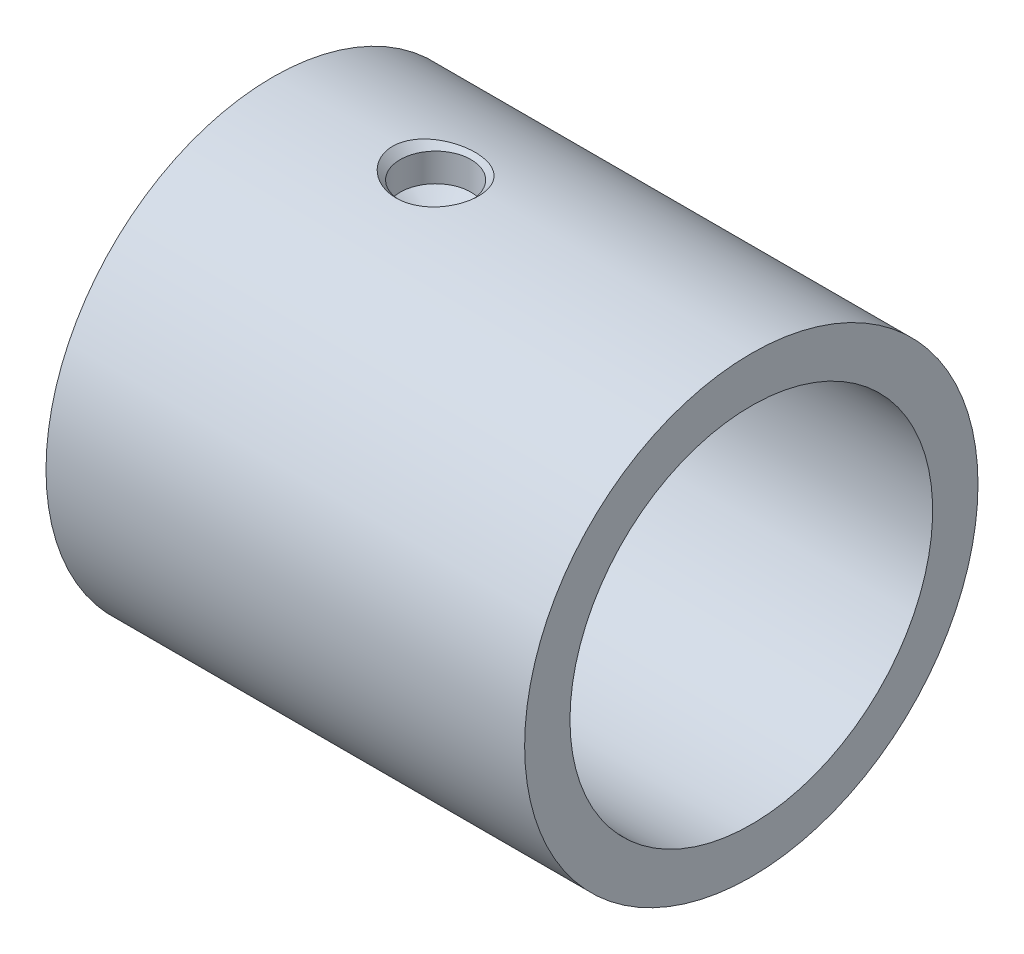
ISO-10303-21;
HEADER;
FILE_DESCRIPTION(('STEP AP214'),'2;1');
FILE_NAME('part.step','',(''),(''),'','','');
FILE_SCHEMA(('AUTOMOTIVE_DESIGN { 1 0 10303 214 1 1 1 1 }'));
ENDSEC;
DATA;
#1=APPLICATION_CONTEXT('core data for automotive mechanical design processes');
#2=APPLICATION_PROTOCOL_DEFINITION('international standard','automotive_design',2000,#1);
#3=PRODUCT_CONTEXT('',#1,'mechanical');
#4=PRODUCT('Part','Part','',(#3));
#5=PRODUCT_RELATED_PRODUCT_CATEGORY('part','',(#4));
#6=PRODUCT_DEFINITION_FORMATION('','',#4);
#7=PRODUCT_DEFINITION_CONTEXT('part definition',#1,'design');
#8=PRODUCT_DEFINITION('design','',#6,#7);
#9=PRODUCT_DEFINITION_SHAPE('','',#8);
#10=(LENGTH_UNIT() NAMED_UNIT(*) SI_UNIT(.MILLI.,.METRE.));
#11=(NAMED_UNIT(*) PLANE_ANGLE_UNIT() SI_UNIT($,.RADIAN.));
#12=(NAMED_UNIT(*) SI_UNIT($,.STERADIAN.) SOLID_ANGLE_UNIT());
#13=UNCERTAINTY_MEASURE_WITH_UNIT(LENGTH_MEASURE(1.E-05),#10,'distance_accuracy_value','');
#14=(GEOMETRIC_REPRESENTATION_CONTEXT(3) GLOBAL_UNCERTAINTY_ASSIGNED_CONTEXT((#13)) GLOBAL_UNIT_ASSIGNED_CONTEXT((#10,
#11,#12)) REPRESENTATION_CONTEXT('',''));
#15=CARTESIAN_POINT('',(0.,0.,0.));
#16=DIRECTION('',(0.,0.,1.));
#17=DIRECTION('',(1.,0.,0.));
#18=AXIS2_PLACEMENT_3D('',#15,#16,#17);
#19=CARTESIAN_POINT('',(7.76605,0.,0.));
#20=DIRECTION('',(-1.,0.,0.));
#21=DIRECTION('',(0.,0.,1.));
#22=AXIS2_PLACEMENT_3D('',#19,#20,#21);
#23=CYLINDRICAL_SURFACE('',#22,4.09575);
#24=CARTESIAN_POINT('',(-17.907,0.,0.));
#25=DIRECTION('',(-1.,0.,0.));
#26=DIRECTION('',(0.,0.,1.));
#27=AXIS2_PLACEMENT_3D('',#24,#25,#26);
#28=CIRCLE('',#27,4.09575);
#29=CARTESIAN_POINT('',(-17.907,0.,4.09575));
#30=VERTEX_POINT('',#29);
#31=EDGE_CURVE('E18',#30,#30,#28,.F.);
#32=ORIENTED_EDGE('',*,*,#31,.F.);
#33=EDGE_LOOP('',(#32));
#34=FACE_BOUND('',#33,.T.);
#35=CARTESIAN_POINT('',(-11.852275,0.,0.));
#36=DIRECTION('',(-1.,0.,0.));
#37=DIRECTION('',(0.,0.,1.));
#38=AXIS2_PLACEMENT_3D('',#35,#36,#37);
#39=CIRCLE('',#38,4.09575);
#40=CARTESIAN_POINT('',(-11.852275,0.,4.09575));
#41=VERTEX_POINT('',#40);
#42=EDGE_CURVE('E142',#41,#41,#39,.T.);
#43=ORIENTED_EDGE('',*,*,#42,.F.);
#44=EDGE_LOOP('',(#43));
#45=FACE_BOUND('',#44,.T.);
#46=ADVANCED_FACE('F15',(#34,#45),#23,.F.);
#47=CARTESIAN_POINT('',(-17.907,12.192,0.));
#48=DIRECTION('',(-1.,0.,0.));
#49=DIRECTION('',(0.,0.,1.));
#50=AXIS2_PLACEMENT_3D('',#47,#48,#49);
#51=PLANE('',#50);
#52=CARTESIAN_POINT('',(-17.907,0.,0.));
#53=DIRECTION('',(-1.,0.,0.));
#54=DIRECTION('',(0.,0.,1.));
#55=AXIS2_PLACEMENT_3D('',#52,#53,#54);
#56=CIRCLE('',#55,12.192);
#57=CARTESIAN_POINT('',(-17.907,0.,12.192));
#58=VERTEX_POINT('',#57);
#59=EDGE_CURVE('E91',#58,#58,#56,.T.);
#60=ORIENTED_EDGE('',*,*,#59,.T.);
#61=EDGE_LOOP('',(#60));
#62=FACE_BOUND('',#61,.T.);
#63=ORIENTED_EDGE('',*,*,#31,.T.);
#64=EDGE_LOOP('',(#63));
#65=FACE_BOUND('',#64,.T.);
#66=ADVANCED_FACE('F149',(#62,#65),#51,.T.);
#67=CARTESIAN_POINT('',(-11.852275,4.09575,0.));
#68=DIRECTION('',(1.,0.,0.));
#69=DIRECTION('',(0.,0.,-1.));
#70=AXIS2_PLACEMENT_3D('',#67,#68,#69);
#71=PLANE('',#70);
#72=ORIENTED_EDGE('',*,*,#42,.T.);
#73=EDGE_LOOP('',(#72));
#74=FACE_BOUND('',#73,.T.);
#75=CARTESIAN_POINT('',(-11.852275,0.,0.));
#76=DIRECTION('',(-1.,0.,0.));
#77=DIRECTION('',(0.,0.,1.));
#78=AXIS2_PLACEMENT_3D('',#75,#76,#77);
#79=CIRCLE('',#78,8.89);
#80=CARTESIAN_POINT('',(-11.852275,0.,8.89));
#81=VERTEX_POINT('',#80);
#82=EDGE_CURVE('E81',#81,#81,#79,.F.);
#83=ORIENTED_EDGE('',*,*,#82,.T.);
#84=EDGE_LOOP('',(#83));
#85=FACE_BOUND('',#84,.T.);
#86=ADVANCED_FACE('F138',(#74,#85),#71,.T.);
#87=CARTESIAN_POINT('',(7.76605,0.,0.));
#88=DIRECTION('',(-1.,0.,0.));
#89=DIRECTION('',(0.,0.,1.));
#90=AXIS2_PLACEMENT_3D('',#87,#88,#89);
#91=CYLINDRICAL_SURFACE('',#90,12.192);
#92=CARTESIAN_POINT('',(-18.4785,0.,0.));
#93=DIRECTION('',(-1.,0.,0.));
#94=DIRECTION('',(0.,0.,1.));
#95=AXIS2_PLACEMENT_3D('',#92,#93,#94);
#96=CIRCLE('',#95,12.192);
#97=CARTESIAN_POINT('',(-18.4785,0.,12.192));
#98=VERTEX_POINT('',#97);
#99=EDGE_CURVE('E78',#98,#98,#96,.F.);
#100=ORIENTED_EDGE('',*,*,#99,.F.);
#101=EDGE_LOOP('',(#100));
#102=FACE_BOUND('',#101,.T.);
#103=ORIENTED_EDGE('',*,*,#59,.F.);
#104=EDGE_LOOP('',(#103));
#105=FACE_BOUND('',#104,.T.);
#106=ADVANCED_FACE('F135',(#102,#105),#91,.F.);
#107=CARTESIAN_POINT('',(-9.921875,7.62,0.));
#108=DIRECTION('',(0.,1.,0.));
#109=DIRECTION('',(0.,0.,1.));
#110=AXIS2_PLACEMENT_3D('',#107,#108,#109);
#111=CYLINDRICAL_SURFACE('',#110,0.482600000000003);
#112=CARTESIAN_POINT('',(-9.921875,9.81981628729045,0.));
#113=DIRECTION('',(0.,1.,0.));
#114=DIRECTION('',(0.,0.,1.));
#115=AXIS2_PLACEMENT_3D('',#112,#113,#114);
#116=CIRCLE('',#115,0.482599999998001);
#117=CARTESIAN_POINT('',(-9.921875,9.81981628729045,0.482599999998001));
#118=VERTEX_POINT('',#117);
#119=EDGE_CURVE('E77',#118,#118,#116,.T.);
#120=ORIENTED_EDGE('',*,*,#119,.T.);
#121=EDGE_LOOP('',(#120));
#122=FACE_BOUND('',#121,.T.);
#123=CARTESIAN_POINT('',(-9.82614427658155,8.87740736991403,-0.473009924420141));
#124=CARTESIAN_POINT('',(-9.79957875000451,8.87769399457319,-0.467632207770437));
#125=CARTESIAN_POINT('',(-9.77344957631398,8.87809605118242,-0.460007726246773));
#126=CARTESIAN_POINT('',(-9.72282363802288,8.87908641331586,-0.440475991727878));
#127=CARTESIAN_POINT('',(-9.69832884627679,8.87967493917275,-0.428563669928886));
#128=CARTESIAN_POINT('',(-9.6516992645904,8.8809711713723,-0.400803400024801));
#129=CARTESIAN_POINT('',(-9.62956325779458,8.88167881577295,-0.384957495372142));
#130=CARTESIAN_POINT('',(-9.58827086182235,8.88313358542776,-0.349780791820837));
#131=CARTESIAN_POINT('',(-9.56911376193617,8.88388070120764,-0.3304508265354));
#132=CARTESIAN_POINT('',(-9.53429813350717,8.88533114027226,-0.28883144466272));
#133=CARTESIAN_POINT('',(-9.5186426726989,8.88603442477103,-0.266539460132842));
#134=CARTESIAN_POINT('',(-9.49129606833774,8.88731726183923,-0.219639338692451));
#135=CARTESIAN_POINT('',(-9.47960506283885,8.88789681009954,-0.195031121161996));
#136=CARTESIAN_POINT('',(-9.46052560326193,8.88886658656717,-0.144207938414712));
#137=CARTESIAN_POINT('',(-9.45313533512205,8.88925689458489,-0.117993655804838));
#138=CARTESIAN_POINT('',(-9.44286141756374,8.88980453108768,-0.0646941166531878));
#139=CARTESIAN_POINT('',(-9.43997772001651,8.88996186206087,-0.0376088694162019));
#140=CARTESIAN_POINT('',(-9.43880038472666,8.89002575657104,0.0166259572508748));
#141=CARTESIAN_POINT('',(-9.44050075439526,8.88993264749979,0.0437754063803727));
#142=CARTESIAN_POINT('',(-9.44843000120689,8.88950684730702,0.0974026745229268));
#143=CARTESIAN_POINT('',(-9.45465886527217,8.88917415687737,0.123880495475336));
#144=CARTESIAN_POINT('',(-9.47146553239069,8.88830670250993,0.175409153450154));
#145=CARTESIAN_POINT('',(-9.48204258718902,8.88777197334109,0.20046023514779));
#146=CARTESIAN_POINT('',(-9.50724467456889,8.88656051852171,0.248432256386781));
#147=CARTESIAN_POINT('',(-9.52186974545073,8.88588379152767,0.271353175770871));
#148=CARTESIAN_POINT('',(-9.55477400482097,8.88446344649949,0.314444607369812));
#149=CARTESIAN_POINT('',(-9.57305767071269,8.88371974712368,0.334611698055138));
#150=CARTESIAN_POINT('',(-9.61275050440093,8.88224986912619,0.371591951797543));
#151=CARTESIAN_POINT('',(-9.63415968615275,8.88152369058276,0.388405099878605));
#152=CARTESIAN_POINT('',(-9.67951476523311,8.88017017706876,0.418211880556562));
#153=CARTESIAN_POINT('',(-9.70346247558612,8.87954291354985,0.431202757933013));
#154=CARTESIAN_POINT('',(-9.75320296778948,8.87845875935599,0.452978550409937));
#155=CARTESIAN_POINT('',(-9.77899573803825,8.87800186760986,0.461763491954292));
#156=CARTESIAN_POINT('',(-9.8316691786335,8.87731050966785,0.474870046070673));
#157=CARTESIAN_POINT('',(-9.85854882902995,8.87707583976372,0.479195746701158));
#158=CARTESIAN_POINT('',(-9.91265376009075,8.87685476976657,0.483273947977531));
#159=CARTESIAN_POINT('',(-9.93987903810516,8.87686836777121,0.483026483664902));
#160=CARTESIAN_POINT('',(-9.99387003816111,8.87714213107769,0.477968421200341));
#161=CARTESIAN_POINT('',(-10.0206362421369,8.87740201935125,0.47316294990747));
#162=CARTESIAN_POINT('',(-10.0729813877091,8.87813860304364,0.459133788022674));
#163=CARTESIAN_POINT('',(-10.0985603256615,8.87861529912787,0.449910083870812));
#164=CARTESIAN_POINT('',(-10.1478176020915,8.87973198341824,0.427302428540763));
#165=CARTESIAN_POINT('',(-10.1714951266444,8.88037204106875,0.413916707576068));
#166=CARTESIAN_POINT('',(-10.2162688034001,8.8817432641757,0.383366105431827));
#167=CARTESIAN_POINT('',(-10.2373649329398,8.88247443043192,0.366201191076991));
#168=CARTESIAN_POINT('',(-10.2764060469391,8.88394662363846,0.328552670202296));
#169=CARTESIAN_POINT('',(-10.2943468673744,8.88468766225111,0.30806474583512));
#170=CARTESIAN_POINT('',(-10.3265351811532,8.8860951899821,0.264365878041124));
#171=CARTESIAN_POINT('',(-10.3407826695565,8.88676167900073,0.241154930972037));
#172=CARTESIAN_POINT('',(-10.3651811674335,8.88794511634408,0.192663394271536));
#173=CARTESIAN_POINT('',(-10.3753315543897,8.88846204194063,0.167382490830346));
#174=CARTESIAN_POINT('',(-10.3912425978425,8.8892879106279,0.115471931191257));
#175=CARTESIAN_POINT('',(-10.3970032964719,8.88959685571484,0.0888422879413342));
#176=CARTESIAN_POINT('',(-10.4039654933293,8.88997166469836,0.0350255027759708));
#177=CARTESIAN_POINT('',(-10.4051726394068,8.89003782971645,0.00783909355718573));
#178=CARTESIAN_POINT('',(-10.4030087609005,8.889920462864,-0.0463503140182477));
#179=CARTESIAN_POINT('',(-10.3996377493663,8.88973693170519,-0.0733533128974698));
#180=CARTESIAN_POINT('',(-10.3884181697519,8.8891410595617,-0.126389950971953));
#181=CARTESIAN_POINT('',(-10.3805727300911,8.88872887844941,-0.152424253924149));
#182=CARTESIAN_POINT('',(-10.360630439844,8.88772214959236,-0.202806442629084));
#183=CARTESIAN_POINT('',(-10.3485335542496,8.88712760034591,-0.22715431449307));
#184=CARTESIAN_POINT('',(-10.3204184832956,8.88582227760244,-0.273497898027663));
#185=CARTESIAN_POINT('',(-10.3043965852432,8.88511139427692,-0.295491354171567));
#186=CARTESIAN_POINT('',(-10.2688917720571,8.88365376190074,-0.336477652369509));
#187=CARTESIAN_POINT('',(-10.2494089619695,8.88290701393916,-0.355470585462949));
#188=CARTESIAN_POINT('',(-10.20751136358,8.88146088388832,-0.389937485778462));
#189=CARTESIAN_POINT('',(-10.1850936387286,8.880761550318,-0.40540788546459));
#190=CARTESIAN_POINT('',(-10.1379694537833,8.87948985559344,-0.432368934057876));
#191=CARTESIAN_POINT('',(-10.1132624487522,8.8789175247814,-0.443858632303601));
#192=CARTESIAN_POINT('',(-10.0622681021591,8.87796472672796,-0.462525781757556));
#193=CARTESIAN_POINT('',(-10.0359807226157,8.87758426409983,-0.469703129280584));
#194=CARTESIAN_POINT('',(-9.98259279441137,8.87705885324477,-0.479532237108307));
#195=CARTESIAN_POINT('',(-9.95549324525003,8.87691362674066,-0.482189344906503));
#196=CARTESIAN_POINT('',(-9.91123200233697,8.8768808942968,-0.482788151051405));
#197=CARTESIAN_POINT('',(-9.89407730591717,8.87691830196737,-0.482103680671892));
#198=CARTESIAN_POINT('',(-9.85993826205239,8.87709085735661,-0.478915971420712));
#199=CARTESIAN_POINT('',(-9.84295391432893,8.87722600491545,-0.476412735522997));
#200=CARTESIAN_POINT('',(-9.82614427658155,8.87740736991403,-0.473009924420141));
#201=B_SPLINE_CURVE_WITH_KNOTS('',3,(#123,#124,#125,#126,#127,#128,#129,#130,#131,#132,#133,
#134,#135,#136,#137,#138,#139,#140,#141,#142,#143,#144,#145,#146,#147,#148,#149,#150,#151,#152,
#153,#154,#155,#156,#157,#158,#159,#160,#161,#162,#163,#164,#165,#166,#167,#168,#169,#170,#171,
#172,#173,#174,#175,#176,#177,#178,#179,#180,#181,#182,#183,#184,#185,#186,#187,#188,#189,#190,
#191,#192,#193,#194,#195,#196,#197,#198,#199,#200),.UNSPECIFIED.,.T.,.F.,(4,2,2,2,2,2,2,2,2,2,2,
2,2,2,2,2,2,2,2,2,2,2,2,2,2,2,2,2,2,2,2,2,2,2,2,2,2,2,4),(0.,0.0812550198844037,
0.16260641129678,0.243915629685114,0.325205419399298,0.406566149359511,0.487929712249111,
0.569258930861346,0.650587280896268,0.731809364829836,0.81303121420469,0.894239092429724,
0.975447739029076,1.05675638370184,1.13806539142566,1.21943286661019,1.30079983020815,
1.38209213322532,1.46338381334749,1.54458416465695,1.62578476517886,1.70701994141771,
1.78825583080024,1.86959813466399,1.95094054733096,2.0322953145944,2.11364930099563,
2.19490234940817,2.2761551662169,2.35735124240911,2.43854798721938,2.51982183510197,
2.60109321656654,2.68244654517892,2.76381928902457,2.8451939893001,2.92647235528949,
2.97788747325627,3.02930250715186),.UNSPECIFIED.);
#202=CARTESIAN_POINT('',(-9.82614427658155,8.87740736991403,-0.473009924420141));
#203=VERTEX_POINT('',#202);
#204=EDGE_CURVE('E84',#203,#203,#201,.T.);
#205=ORIENTED_EDGE('',*,*,#204,.T.);
#206=EDGE_LOOP('',(#205));
#207=FACE_BOUND('',#206,.T.);
#208=ADVANCED_FACE('F92',(#122,#207),#111,.F.);
#209=CARTESIAN_POINT('',(7.76605,0.,0.));
#210=DIRECTION('',(-1.,0.,0.));
#211=DIRECTION('',(0.,0.,1.));
#212=AXIS2_PLACEMENT_3D('',#209,#210,#211);
#213=CYLINDRICAL_SURFACE('',#212,8.89);
#214=ORIENTED_EDGE('',*,*,#82,.F.);
#215=EDGE_LOOP('',(#214));
#216=FACE_BOUND('',#215,.T.);
#217=ORIENTED_EDGE('',*,*,#204,.F.);
#218=EDGE_LOOP('',(#217));
#219=FACE_BOUND('',#218,.T.);
#220=CARTESIAN_POINT('',(-7.991475,0.,0.));
#221=DIRECTION('',(-1.,0.,0.));
#222=DIRECTION('',(0.,0.,1.));
#223=AXIS2_PLACEMENT_3D('',#220,#221,#222);
#224=CIRCLE('',#223,8.89);
#225=CARTESIAN_POINT('',(-7.991475,0.,8.89));
#226=VERTEX_POINT('',#225);
#227=EDGE_CURVE('E74',#226,#226,#224,.T.);
#228=ORIENTED_EDGE('',*,*,#227,.F.);
#229=EDGE_LOOP('',(#228));
#230=FACE_BOUND('',#229,.T.);
#231=ADVANCED_FACE('F95',(#216,#219,#230),#213,.F.);
#232=CARTESIAN_POINT('',(-18.4785,11.684,0.));
#233=DIRECTION('',(1.,0.,0.));
#234=DIRECTION('',(0.,0.,-1.));
#235=AXIS2_PLACEMENT_3D('',#232,#233,#234);
#236=PLANE('',#235);
#237=CARTESIAN_POINT('',(-18.4785,0.,0.));
#238=DIRECTION('',(-1.,0.,0.));
#239=DIRECTION('',(0.,0.,1.));
#240=AXIS2_PLACEMENT_3D('',#237,#238,#239);
#241=CIRCLE('',#240,11.684);
#242=CARTESIAN_POINT('',(-18.4785,0.,11.684));
#243=VERTEX_POINT('',#242);
#244=EDGE_CURVE('E71',#243,#243,#241,.T.);
#245=ORIENTED_EDGE('',*,*,#244,.T.);
#246=EDGE_LOOP('',(#245));
#247=FACE_BOUND('',#246,.T.);
#248=ORIENTED_EDGE('',*,*,#99,.T.);
#249=EDGE_LOOP('',(#248));
#250=FACE_BOUND('',#249,.T.);
#251=ADVANCED_FACE('F99',(#247,#250),#236,.T.);
#252=CARTESIAN_POINT('',(-9.921875,10.68649987036,0.));
#253=DIRECTION('',(0.,1.,0.));
#254=DIRECTION('',(0.,0.,1.));
#255=AXIS2_PLACEMENT_3D('',#252,#253,#254);
#256=CONICAL_SURFACE('',#255,1.98373999995738,1.04719755119577);
#257=CARTESIAN_POINT('',(-9.921875,10.686499870343,0.));
#258=DIRECTION('',(0.,1.,0.));
#259=DIRECTION('',(0.,0.,1.));
#260=AXIS2_PLACEMENT_3D('',#257,#258,#259);
#261=CIRCLE('',#260,1.98374);
#262=CARTESIAN_POINT('',(-9.921875,10.686499870343,1.98374));
#263=VERTEX_POINT('',#262);
#264=EDGE_CURVE('E70',#263,#263,#261,.T.);
#265=ORIENTED_EDGE('',*,*,#264,.T.);
#266=EDGE_LOOP('',(#265));
#267=FACE_BOUND('',#266,.T.);
#268=ORIENTED_EDGE('',*,*,#119,.F.);
#269=EDGE_LOOP('',(#268));
#270=FACE_BOUND('',#269,.T.);
#271=ADVANCED_FACE('F103',(#267,#270),#256,.F.);
#272=CARTESIAN_POINT('',(-7.991475,8.89,0.));
#273=DIRECTION('',(1.,0.,0.));
#274=DIRECTION('',(0.,0.,-1.));
#275=AXIS2_PLACEMENT_3D('',#272,#273,#274);
#276=PLANE('',#275);
#277=ORIENTED_EDGE('',*,*,#227,.T.);
#278=EDGE_LOOP('',(#277));
#279=FACE_BOUND('',#278,.T.);
#280=CARTESIAN_POINT('',(-7.991475,0.,0.));
#281=DIRECTION('',(-1.,0.,0.));
#282=DIRECTION('',(0.,0.,1.));
#283=AXIS2_PLACEMENT_3D('',#280,#281,#282);
#284=CIRCLE('',#283,10.16);
#285=CARTESIAN_POINT('',(-7.991475,0.,10.16));
#286=VERTEX_POINT('',#285);
#287=EDGE_CURVE('E67',#286,#286,#284,.F.);
#288=ORIENTED_EDGE('',*,*,#287,.T.);
#289=EDGE_LOOP('',(#288));
#290=FACE_BOUND('',#289,.T.);
#291=ADVANCED_FACE('F107',(#279,#290),#276,.T.);
#292=CARTESIAN_POINT('',(7.76605,0.,0.));
#293=DIRECTION('',(-1.,0.,0.));
#294=DIRECTION('',(0.,0.,1.));
#295=AXIS2_PLACEMENT_3D('',#292,#293,#294);
#296=CYLINDRICAL_SURFACE('',#295,11.684);
#297=CARTESIAN_POINT('',(-19.05,0.,0.));
#298=DIRECTION('',(-1.,0.,0.));
#299=DIRECTION('',(0.,0.,1.));
#300=AXIS2_PLACEMENT_3D('',#297,#298,#299);
#301=CIRCLE('',#300,11.684);
#302=CARTESIAN_POINT('',(-19.05,0.,11.684));
#303=VERTEX_POINT('',#302);
#304=EDGE_CURVE('E62',#303,#303,#301,.F.);
#305=ORIENTED_EDGE('',*,*,#304,.F.);
#306=EDGE_LOOP('',(#305));
#307=FACE_BOUND('',#306,.T.);
#308=ORIENTED_EDGE('',*,*,#244,.F.);
#309=EDGE_LOOP('',(#308));
#310=FACE_BOUND('',#309,.T.);
#311=ADVANCED_FACE('F111',(#307,#310),#296,.F.);
#312=CARTESIAN_POINT('',(-9.921875,7.62,0.));
#313=DIRECTION('',(0.,1.,0.));
#314=DIRECTION('',(0.,0.,1.));
#315=AXIS2_PLACEMENT_3D('',#312,#313,#314);
#316=CYLINDRICAL_SURFACE('',#315,1.98374);
#317=CARTESIAN_POINT('',(-9.921875,12.2707400000763,0.));
#318=DIRECTION('',(0.,1.,0.));
#319=DIRECTION('',(0.,0.,1.));
#320=AXIS2_PLACEMENT_3D('',#317,#318,#319);
#321=CIRCLE('',#320,1.98373999995738);
#322=CARTESIAN_POINT('',(-9.921875,12.2707400000763,1.98373999995738));
#323=VERTEX_POINT('',#322);
#324=EDGE_CURVE('E59',#323,#323,#321,.T.);
#325=ORIENTED_EDGE('',*,*,#324,.T.);
#326=EDGE_LOOP('',(#325));
#327=FACE_BOUND('',#326,.T.);
#328=ORIENTED_EDGE('',*,*,#264,.F.);
#329=EDGE_LOOP('',(#328));
#330=FACE_BOUND('',#329,.T.);
#331=ADVANCED_FACE('F115',(#327,#330),#316,.F.);
#332=CARTESIAN_POINT('',(7.76605,0.,0.));
#333=DIRECTION('',(-1.,0.,0.));
#334=DIRECTION('',(0.,0.,1.));
#335=AXIS2_PLACEMENT_3D('',#332,#333,#334);
#336=CYLINDRICAL_SURFACE('',#335,10.16);
#337=ORIENTED_EDGE('',*,*,#287,.F.);
#338=EDGE_LOOP('',(#337));
#339=FACE_BOUND('',#338,.T.);
#340=CARTESIAN_POINT('',(7.76605,0.,0.));
#341=DIRECTION('',(-1.,0.,0.));
#342=DIRECTION('',(0.,0.,1.));
#343=AXIS2_PLACEMENT_3D('',#340,#341,#342);
#344=CIRCLE('',#343,10.16);
#345=CARTESIAN_POINT('',(7.76605,0.,10.16));
#346=VERTEX_POINT('',#345);
#347=EDGE_CURVE('E57',#346,#346,#344,.T.);
#348=ORIENTED_EDGE('',*,*,#347,.F.);
#349=EDGE_LOOP('',(#348));
#350=FACE_BOUND('',#349,.T.);
#351=ADVANCED_FACE('F119',(#339,#350),#336,.F.);
#352=CARTESIAN_POINT('',(-19.05,12.7,0.));
#353=DIRECTION('',(-1.,0.,0.));
#354=DIRECTION('',(0.,0.,1.));
#355=AXIS2_PLACEMENT_3D('',#352,#353,#354);
#356=PLANE('',#355);
#357=CARTESIAN_POINT('',(-19.05,0.,0.));
#358=DIRECTION('',(-1.,0.,0.));
#359=DIRECTION('',(0.,0.,1.));
#360=AXIS2_PLACEMENT_3D('',#357,#358,#359);
#361=CIRCLE('',#360,12.7);
#362=CARTESIAN_POINT('',(-19.05,0.,12.7));
#363=VERTEX_POINT('',#362);
#364=EDGE_CURVE('E27',#363,#363,#361,.F.);
#365=ORIENTED_EDGE('',*,*,#364,.F.);
#366=EDGE_LOOP('',(#365));
#367=FACE_BOUND('',#366,.T.);
#368=ORIENTED_EDGE('',*,*,#304,.T.);
#369=EDGE_LOOP('',(#368));
#370=FACE_BOUND('',#369,.T.);
#371=ADVANCED_FACE('F52',(#367,#370),#356,.T.);
#372=CARTESIAN_POINT('',(-9.921875,12.7045130008696,0.));
#373=DIRECTION('',(0.,1.,0.));
#374=DIRECTION('',(0.,0.,1.));
#375=AXIS2_PLACEMENT_3D('',#372,#373,#374);
#376=CONICAL_SURFACE('',#375,2.41751300075066,0.785398163397448);
#377=CARTESIAN_POINT('',(-11.5051743130375,12.5894939624986,-1.67171819978518));
#378=CARTESIAN_POINT('',(-11.4166308984851,12.5800807737112,-1.74261076388826));
#379=CARTESIAN_POINT('',(-11.3229783550062,12.5708993813322,-1.80718065135573));
#380=CARTESIAN_POINT('',(-11.1275338604303,12.5537296615263,-1.92283482671889));
#381=CARTESIAN_POINT('',(-11.0257351235432,12.5457423449886,-1.97390771599723));
#382=CARTESIAN_POINT('',(-10.7938525443919,12.5300833072515,-2.07122105425727));
#383=CARTESIAN_POINT('',(-10.6623391790981,12.5228353975745,-2.11415646512729));
#384=CARTESIAN_POINT('',(-10.3939897566558,12.5118018653315,-2.17850437990868));
#385=CARTESIAN_POINT('',(-10.2571512918084,12.5080178283415,-2.19990702771388));
#386=CARTESIAN_POINT('',(-9.97661547706143,12.5042555242097,-2.22119948146056));
#387=CARTESIAN_POINT('',(-9.83285231867308,12.5044240429706,-2.22025953450896));
#388=CARTESIAN_POINT('',(-9.54748624158228,12.5089131149614,-2.19482418360035));
#389=CARTESIAN_POINT('',(-9.40588344164839,12.5132338956377,-2.17032748928675));
#390=CARTESIAN_POINT('',(-9.12778080768169,12.525572527271,-2.09794767719697));
#391=CARTESIAN_POINT('',(-8.99132792327561,12.5336182204415,-2.04988827525398));
#392=CARTESIAN_POINT('',(-8.72878274269676,12.5524544874788,-1.93118646636451));
#393=CARTESIAN_POINT('',(-8.60269083075648,12.5632451630814,-1.86054322238005));
#394=CARTESIAN_POINT('',(-8.36787020960961,12.5859631236997,-1.69998021428819));
#395=CARTESIAN_POINT('',(-8.25880358241689,12.5978578086142,-1.6105515073648));
#396=CARTESIAN_POINT('',(-8.05861716764646,12.621493982075,-1.41340207917771));
#397=CARTESIAN_POINT('',(-7.96749007865932,12.6332355311233,-1.30568883311909));
#398=CARTESIAN_POINT('',(-7.8125790344338,12.6542434642849,-1.08250469435253));
#399=CARTESIAN_POINT('',(-7.74737555193304,12.6636227741012,-0.968032124714309));
#400=CARTESIAN_POINT('',(-7.63920222786515,12.6796325083906,-0.728850838413284));
#401=CARTESIAN_POINT('',(-7.59621565052061,12.6862650012634,-0.604149908967114));
#402=CARTESIAN_POINT('',(-7.53757530276088,12.695418971961,-0.360345229285373));
#403=CARTESIAN_POINT('',(-7.51979148731983,12.6982594396591,-0.241763673029298));
#404=CARTESIAN_POINT('',(-7.5053686413023,12.7005582927943,-0.00330327795663621));
#405=CARTESIAN_POINT('',(-7.50872197671653,12.7000178992824,0.116575076887055));
#406=CARTESIAN_POINT('',(-7.53564211947575,12.695743877308,0.347451827557572));
#407=CARTESIAN_POINT('',(-7.55812099189834,12.6921821463037,0.458582768374225));
#408=CARTESIAN_POINT('',(-7.62085710436746,12.6824843220303,0.675569613030363));
#409=CARTESIAN_POINT('',(-7.66111529955768,12.6763480904544,0.781425233128161));
#410=CARTESIAN_POINT('',(-7.75883352988518,12.6619853775893,0.987433802069019));
#411=CARTESIAN_POINT('',(-7.81663745431386,12.6537176593442,1.08742004772833));
#412=CARTESIAN_POINT('',(-7.94704257510278,12.6359859799123,1.27708621184414));
#413=CARTESIAN_POINT('',(-8.01964802547358,12.62652167512,1.36676315575719));
#414=CARTESIAN_POINT('',(-8.18339740017674,12.6065473716977,1.54051537177287));
#415=CARTESIAN_POINT('',(-8.27552619591912,12.5960123260066,1.62365884284539));
#416=CARTESIAN_POINT('',(-8.47157558479711,12.5756188786706,1.77472055139127));
#417=CARTESIAN_POINT('',(-8.57550047007264,12.5657607254282,1.842633220046));
#418=CARTESIAN_POINT('',(-8.80152037961801,12.5468916775749,1.96718533603858));
#419=CARTESIAN_POINT('',(-8.92440802475673,12.5380202764877,2.02240983905879));
#420=CARTESIAN_POINT('',(-9.17750342058654,12.5231000620489,2.11283469853822));
#421=CARTESIAN_POINT('',(-9.30771315140659,12.5170520163772,2.14802960945341));
#422=CARTESIAN_POINT('',(-9.57929038920597,12.5081734171602,2.19916438201941));
#423=CARTESIAN_POINT('',(-9.72088060975674,12.5055343969537,2.21396093329965));
#424=CARTESIAN_POINT('',(-10.0046113773113,12.5043940986823,2.22039095405082));
#425=CARTESIAN_POINT('',(-10.1467520022321,12.5058934295615,2.21202101465134));
#426=CARTESIAN_POINT('',(-10.4301913007259,12.5129229606628,2.17190719622151));
#427=CARTESIAN_POINT('',(-10.5714301790043,12.518524282005,2.13975080242379));
#428=CARTESIAN_POINT('',(-10.8463471214414,12.5331772719222,2.0521758741538));
#429=CARTESIAN_POINT('',(-10.9800246142258,12.5422292008427,1.99675558440844));
#430=CARTESIAN_POINT('',(-11.2341617102692,12.5625680142256,1.86448227191877));
#431=CARTESIAN_POINT('',(-11.3547581131803,12.5738274015146,1.78788861184225));
#432=CARTESIAN_POINT('',(-11.5804049672085,12.5972596858011,1.61451860330018));
#433=CARTESIAN_POINT('',(-11.6854587451104,12.6094323864673,1.51774658457964));
#434=CARTESIAN_POINT('',(-11.8709186520065,12.6324805840125,1.31171654625763));
#435=CARTESIAN_POINT('',(-11.9523135312909,12.6433905953995,1.20335501798603));
#436=CARTESIAN_POINT('',(-12.0937320065774,12.6631724782301,0.973308827787222));
#437=CARTESIAN_POINT('',(-12.1537709196738,12.6720458088109,0.851633796911749));
#438=CARTESIAN_POINT('',(-12.2451411192502,12.6858657063013,0.610025715391945));
#439=CARTESIAN_POINT('',(-12.2785424163144,12.6910902448367,0.490891078738355));
#440=CARTESIAN_POINT('',(-12.3233424435329,12.6981464996128,0.248471877455298));
#441=CARTESIAN_POINT('',(-12.3347534180559,12.6999801039268,0.125189661160963));
#442=CARTESIAN_POINT('',(-12.3349859395943,12.7000181615286,-0.112335674713525));
#443=CARTESIAN_POINT('',(-12.3253984277752,12.6984782088723,-0.226580509585198));
#444=CARTESIAN_POINT('',(-12.2872858207876,12.6924616061356,-0.451781717979389));
#445=CARTESIAN_POINT('',(-12.2587600305431,12.6879848482681,-0.562737970647651));
#446=CARTESIAN_POINT('',(-12.1841860648977,12.6766122180858,-0.777864770709533));
#447=CARTESIAN_POINT('',(-12.1382163452452,12.6697271878966,-0.88206328996132));
#448=CARTESIAN_POINT('',(-12.0305227160329,12.6542404649212,-1.08177538014269));
#449=CARTESIAN_POINT('',(-11.9688023284772,12.6456391560055,-1.17729088621199));
#450=CARTESIAN_POINT('',(-11.843087210079,12.629043548474,-1.34275568292762));
#451=CARTESIAN_POINT('',(-11.7811723165606,12.6211856548861,-1.41431652688962));
#452=CARTESIAN_POINT('',(-11.6490758126568,12.6053295787858,-1.54928418284004));
#453=CARTESIAN_POINT('',(-11.5788959645089,12.5973314264875,-1.61269272703668));
#454=CARTESIAN_POINT('',(-11.5051743130375,12.5894939624986,-1.67171819978518));
#455=B_SPLINE_CURVE_WITH_KNOTS('',3,(#377,#378,#379,#380,#381,#382,#383,#384,#385,#386,#387,
#388,#389,#390,#391,#392,#393,#394,#395,#396,#397,#398,#399,#400,#401,#402,#403,#404,#405,#406,
#407,#408,#409,#410,#411,#412,#413,#414,#415,#416,#417,#418,#419,#420,#421,#422,#423,#424,#425,
#426,#427,#428,#429,#430,#431,#432,#433,#434,#435,#436,#437,#438,#439,#440,#441,#442,#443,#444,
#445,#446,#447,#448,#449,#450,#451,#452,#453,#454),.UNSPECIFIED.,.T.,.F.,(4,2,2,2,2,2,2,2,2,2,2,
2,2,2,2,2,2,2,2,2,2,2,2,2,2,2,2,2,2,2,2,2,2,2,2,2,2,2,4),(0.,0.341205438733946,
0.682698121365354,1.09639547065815,1.51028209396314,1.93956274407369,2.36886691002285,
2.80143308396047,3.23401529220721,3.65645007952722,4.07871257839939,4.4727780497263,
4.86654624113696,5.2245071276078,5.58233873837172,5.92108000041357,6.25983946258293,
6.60572170868041,6.95170350305095,7.32376521806807,7.69596274854964,8.09924085037741,
8.50262854109858,8.9278150760776,9.35306417913717,9.7858663259118,10.2187011337055,
10.646452482014,11.0741121404119,11.4798083373331,11.8852129681137,12.2547476876114,
12.6240765880184,12.9663964273052,13.3087288311681,13.6495394686418,13.9902739641837,
14.2744236478114,14.5585128549156),.UNSPECIFIED.);
#456=CARTESIAN_POINT('',(-11.5051743130375,12.5894939624986,-1.67171819978518));
#457=VERTEX_POINT('',#456);
#458=EDGE_CURVE('E22',#457,#457,#455,.T.);
#459=ORIENTED_EDGE('',*,*,#458,.F.);
#460=EDGE_LOOP('',(#459));
#461=FACE_BOUND('',#460,.T.);
#462=ORIENTED_EDGE('',*,*,#324,.F.);
#463=EDGE_LOOP('',(#462));
#464=FACE_BOUND('',#463,.T.);
#465=ADVANCED_FACE('F38',(#461,#464),#376,.F.);
#466=CARTESIAN_POINT('',(7.76605,10.16,0.));
#467=DIRECTION('',(1.,0.,0.));
#468=DIRECTION('',(0.,0.,-1.));
#469=AXIS2_PLACEMENT_3D('',#466,#467,#468);
#470=PLANE('',#469);
#471=ORIENTED_EDGE('',*,*,#347,.T.);
#472=EDGE_LOOP('',(#471));
#473=FACE_BOUND('',#472,.T.);
#474=CARTESIAN_POINT('',(7.76605,0.,0.));
#475=DIRECTION('',(-1.,0.,0.));
#476=DIRECTION('',(0.,0.,1.));
#477=AXIS2_PLACEMENT_3D('',#474,#475,#476);
#478=CIRCLE('',#477,12.7);
#479=CARTESIAN_POINT('',(7.76605,0.,12.7));
#480=VERTEX_POINT('',#479);
#481=EDGE_CURVE('E10',#480,#480,#478,.T.);
#482=ORIENTED_EDGE('',*,*,#481,.F.);
#483=EDGE_LOOP('',(#482));
#484=FACE_BOUND('',#483,.T.);
#485=ADVANCED_FACE('F45',(#473,#484),#470,.T.);
#486=CARTESIAN_POINT('',(7.76605,0.,0.));
#487=DIRECTION('',(-1.,0.,0.));
#488=DIRECTION('',(0.,0.,1.));
#489=AXIS2_PLACEMENT_3D('',#486,#487,#488);
#490=CYLINDRICAL_SURFACE('',#489,12.7);
#491=ORIENTED_EDGE('',*,*,#481,.T.);
#492=EDGE_LOOP('',(#491));
#493=FACE_BOUND('',#492,.T.);
#494=ORIENTED_EDGE('',*,*,#458,.T.);
#495=EDGE_LOOP('',(#494));
#496=FACE_BOUND('',#495,.T.);
#497=ORIENTED_EDGE('',*,*,#364,.T.);
#498=EDGE_LOOP('',(#497));
#499=FACE_BOUND('',#498,.T.);
#500=ADVANCED_FACE('F42',(#493,#496,#499),#490,.T.);
#501=CLOSED_SHELL('',(#46,#66,#86,#106,#208,#231,#251,#271,#291,#311,#331,#351,#371,#465,#485,#500));
#502=MANIFOLD_SOLID_BREP('B1',#501);
#503=ADVANCED_BREP_SHAPE_REPRESENTATION('',(#18,#502),#14);
#504=SHAPE_DEFINITION_REPRESENTATION(#9,#503);
ENDSEC;
END-ISO-10303-21;
